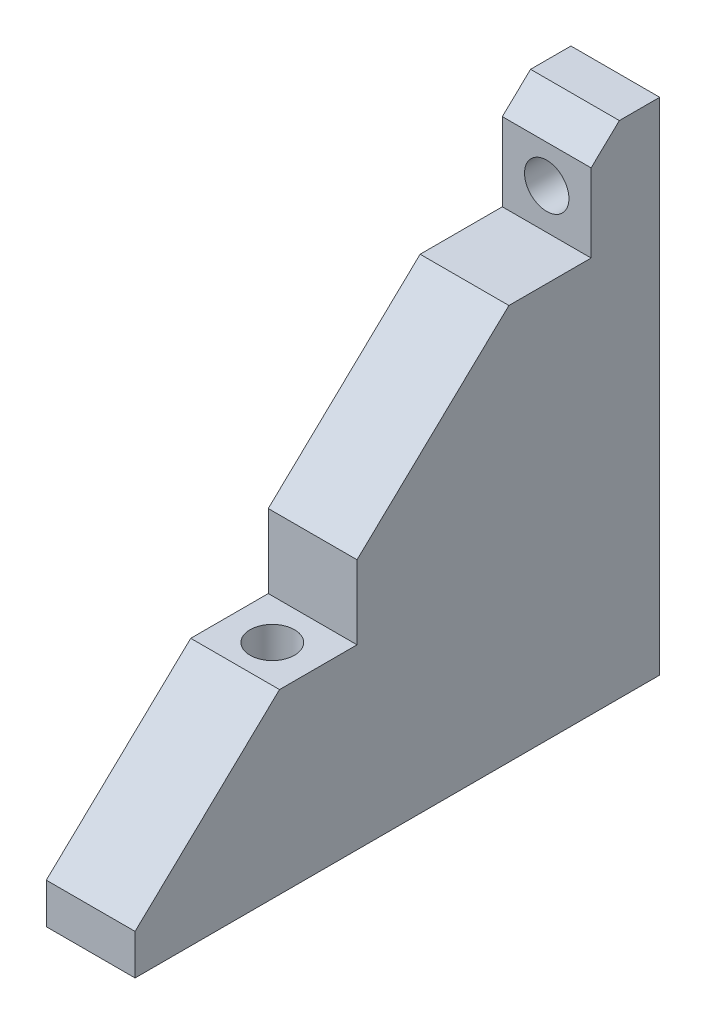
ISO-10303-21;
HEADER;
FILE_DESCRIPTION(('STEP AP214'),'2;1');
FILE_NAME('part.step','',(''),(''),'','','');
FILE_SCHEMA(('AUTOMOTIVE_DESIGN { 1 0 10303 214 1 1 1 1 }'));
ENDSEC;
DATA;
#1=APPLICATION_CONTEXT('core data for automotive mechanical design processes');
#2=APPLICATION_PROTOCOL_DEFINITION('international standard','automotive_design',2000,#1);
#3=PRODUCT_CONTEXT('',#1,'mechanical');
#4=PRODUCT('Part','Part','',(#3));
#5=PRODUCT_RELATED_PRODUCT_CATEGORY('part','',(#4));
#6=PRODUCT_DEFINITION_FORMATION('','',#4);
#7=PRODUCT_DEFINITION_CONTEXT('part definition',#1,'design');
#8=PRODUCT_DEFINITION('design','',#6,#7);
#9=PRODUCT_DEFINITION_SHAPE('','',#8);
#10=(LENGTH_UNIT() NAMED_UNIT(*) SI_UNIT(.MILLI.,.METRE.));
#11=(NAMED_UNIT(*) PLANE_ANGLE_UNIT() SI_UNIT($,.RADIAN.));
#12=(NAMED_UNIT(*) SI_UNIT($,.STERADIAN.) SOLID_ANGLE_UNIT());
#13=UNCERTAINTY_MEASURE_WITH_UNIT(LENGTH_MEASURE(1.E-05),#10,'distance_accuracy_value','');
#14=(GEOMETRIC_REPRESENTATION_CONTEXT(3) GLOBAL_UNCERTAINTY_ASSIGNED_CONTEXT((#13)) GLOBAL_UNIT_ASSIGNED_CONTEXT((#10,
#11,#12)) REPRESENTATION_CONTEXT('',''));
#15=CARTESIAN_POINT('',(0.,0.,0.));
#16=DIRECTION('',(0.,0.,1.));
#17=DIRECTION('',(1.,0.,0.));
#18=AXIS2_PLACEMENT_3D('',#15,#16,#17);
#19=CARTESIAN_POINT('',(-32.5,-80.,-5.));
#20=DIRECTION('',(0.,1.,0.));
#21=DIRECTION('',(0.,0.,1.));
#22=AXIS2_PLACEMENT_3D('',#19,#20,#21);
#23=PLANE('',#22);
#24=DIRECTION('',(0.,0.,1.));
#25=VECTOR('',#24,1.);
#26=CARTESIAN_POINT('',(-25.5,-80.,-5.));
#27=LINE('',#26,#25);
#28=CARTESIAN_POINT('',(-25.5,-80.,-5.));
#29=VERTEX_POINT('',#28);
#30=CARTESIAN_POINT('',(-25.5,-80.,0.));
#31=VERTEX_POINT('',#30);
#32=EDGE_CURVE('E80',#29,#31,#27,.T.);
#33=ORIENTED_EDGE('',*,*,#32,.T.);
#34=DIRECTION('',(1.,0.,0.));
#35=VECTOR('',#34,1.);
#36=CARTESIAN_POINT('',(-32.5,-80.,0.));
#37=LINE('',#36,#35);
#38=CARTESIAN_POINT('',(-14.5,-80.,0.));
#39=VERTEX_POINT('',#38);
#40=EDGE_CURVE('E87',#31,#39,#37,.T.);
#41=ORIENTED_EDGE('',*,*,#40,.T.);
#42=DIRECTION('',(0.,0.,1.));
#43=VECTOR('',#42,1.);
#44=CARTESIAN_POINT('',(-14.5,-80.,-5.));
#45=LINE('',#44,#43);
#46=CARTESIAN_POINT('',(-14.5,-80.,-5.));
#47=VERTEX_POINT('',#46);
#48=EDGE_CURVE('E131',#47,#39,#45,.T.);
#49=ORIENTED_EDGE('',*,*,#48,.F.);
#50=DIRECTION('',(-1.,0.,0.));
#51=VECTOR('',#50,1.);
#52=CARTESIAN_POINT('',(-32.5,-80.,-5.));
#53=LINE('',#52,#51);
#54=EDGE_CURVE('E89',#47,#29,#53,.T.);
#55=ORIENTED_EDGE('',*,*,#54,.T.);
#56=EDGE_LOOP('',(#33,#41,#49,#55));
#57=FACE_BOUND('',#56,.T.);
#58=ADVANCED_FACE('F39',(#57),#23,.T.);
#59=CARTESIAN_POINT('',(0.,0.,-5.));
#60=DIRECTION('',(0.,0.,-1.));
#61=DIRECTION('',(-1.,0.,0.));
#62=AXIS2_PLACEMENT_3D('',#59,#60,#61);
#63=PLANE('',#62);
#64=DIRECTION('',(0.,1.,0.));
#65=VECTOR('',#64,1.);
#66=CARTESIAN_POINT('',(-25.5,-80.,-5.));
#67=LINE('',#66,#65);
#68=CARTESIAN_POINT('',(-25.5,-142.,-5.));
#69=VERTEX_POINT('',#68);
#70=EDGE_CURVE('E113',#69,#29,#67,.T.);
#71=ORIENTED_EDGE('',*,*,#70,.T.);
#72=ORIENTED_EDGE('',*,*,#54,.F.);
#73=DIRECTION('',(0.,-1.,0.));
#74=VECTOR('',#73,1.);
#75=CARTESIAN_POINT('',(-14.5,-80.,-5.));
#76=LINE('',#75,#74);
#77=CARTESIAN_POINT('',(-14.5,-142.,-5.));
#78=VERTEX_POINT('',#77);
#79=EDGE_CURVE('E127',#47,#78,#76,.T.);
#80=ORIENTED_EDGE('',*,*,#79,.T.);
#81=DIRECTION('',(1.,0.,0.));
#82=VECTOR('',#81,1.);
#83=CARTESIAN_POINT('',(-32.5,-142.,-5.));
#84=LINE('',#83,#82);
#85=EDGE_CURVE('E116',#69,#78,#84,.T.);
#86=ORIENTED_EDGE('',*,*,#85,.F.);
#87=EDGE_LOOP('',(#71,#72,#80,#86));
#88=FACE_BOUND('',#87,.T.);
#89=CARTESIAN_POINT('',(-20.,-88.,-5.));
#90=DIRECTION('',(0.,0.,1.));
#91=DIRECTION('',(1.,0.,0.));
#92=AXIS2_PLACEMENT_3D('',#89,#90,#91);
#93=CIRCLE('',#92,2.75);
#94=CARTESIAN_POINT('',(-17.25,-88.,-5.));
#95=VERTEX_POINT('',#94);
#96=EDGE_CURVE('E124',#95,#95,#93,.T.);
#97=ORIENTED_EDGE('',*,*,#96,.T.);
#98=EDGE_LOOP('',(#97));
#99=FACE_BOUND('',#98,.T.);
#100=ADVANCED_FACE('F275',(#88,#99),#63,.T.);
#101=CARTESIAN_POINT('',(0.,-142.,0.));
#102=DIRECTION('',(0.,1.,0.));
#103=DIRECTION('',(0.,0.,1.));
#104=AXIS2_PLACEMENT_3D('',#101,#102,#103);
#105=PLANE('',#104);
#106=CARTESIAN_POINT('',(-20.,-142.,37.5));
#107=DIRECTION('',(0.,-1.,0.));
#108=DIRECTION('',(0.,0.,1.));
#109=AXIS2_PLACEMENT_3D('',#106,#107,#108);
#110=CIRCLE('',#109,2.75);
#111=CARTESIAN_POINT('',(-20.,-142.,40.25));
#112=VERTEX_POINT('',#111);
#113=EDGE_CURVE('E197',#112,#112,#110,.T.);
#114=ORIENTED_EDGE('',*,*,#113,.F.);
#115=EDGE_LOOP('',(#114));
#116=FACE_BOUND('',#115,.T.);
#117=CARTESIAN_POINT('',(-20.,-142.,7.50000000000001));
#118=DIRECTION('',(0.,-1.,0.));
#119=DIRECTION('',(0.,0.,1.));
#120=AXIS2_PLACEMENT_3D('',#117,#118,#119);
#121=CIRCLE('',#120,5.);
#122=CARTESIAN_POINT('',(-20.,-142.,12.5));
#123=VERTEX_POINT('',#122);
#124=EDGE_CURVE('E202',#123,#123,#121,.T.);
#125=ORIENTED_EDGE('',*,*,#124,.F.);
#126=EDGE_LOOP('',(#125));
#127=FACE_BOUND('',#126,.T.);
#128=CARTESIAN_POINT('',(-20.,-142.,47.5));
#129=DIRECTION('',(0.,-1.,0.));
#130=DIRECTION('',(0.,0.,-1.));
#131=AXIS2_PLACEMENT_3D('',#128,#129,#130);
#132=CIRCLE('',#131,5.);
#133=CARTESIAN_POINT('',(-20.,-142.,42.5));
#134=VERTEX_POINT('',#133);
#135=EDGE_CURVE('E206',#134,#134,#132,.T.);
#136=ORIENTED_EDGE('',*,*,#135,.F.);
#137=EDGE_LOOP('',(#136));
#138=FACE_BOUND('',#137,.T.);
#139=DIRECTION('',(-1.,0.,0.));
#140=VECTOR('',#139,1.);
#141=CARTESIAN_POINT('',(-32.5,-142.,60.));
#142=LINE('',#141,#140);
#143=CARTESIAN_POINT('',(-14.5,-142.,60.));
#144=VERTEX_POINT('',#143);
#145=CARTESIAN_POINT('',(-25.5,-142.,60.));
#146=VERTEX_POINT('',#145);
#147=EDGE_CURVE('E121',#144,#146,#142,.T.);
#148=ORIENTED_EDGE('',*,*,#147,.T.);
#149=DIRECTION('',(0.,0.,1.));
#150=VECTOR('',#149,1.);
#151=CARTESIAN_POINT('',(-25.5,-142.,-5.));
#152=LINE('',#151,#150);
#153=EDGE_CURVE('E49',#69,#146,#152,.T.);
#154=ORIENTED_EDGE('',*,*,#153,.F.);
#155=ORIENTED_EDGE('',*,*,#85,.T.);
#156=DIRECTION('',(0.,0.,1.));
#157=VECTOR('',#156,1.);
#158=CARTESIAN_POINT('',(-14.5,-142.,-5.));
#159=LINE('',#158,#157);
#160=EDGE_CURVE('E120',#78,#144,#159,.T.);
#161=ORIENTED_EDGE('',*,*,#160,.T.);
#162=EDGE_LOOP('',(#148,#154,#155,#161));
#163=FACE_BOUND('',#162,.T.);
#164=ADVANCED_FACE('F272',(#116,#127,#138,#163),#105,.F.);
#165=CARTESIAN_POINT('',(-32.5,-142.,60.));
#166=DIRECTION('',(0.,0.,-1.));
#167=DIRECTION('',(-1.,0.,0.));
#168=AXIS2_PLACEMENT_3D('',#165,#166,#167);
#169=PLANE('',#168);
#170=DIRECTION('',(1.,0.,0.));
#171=VECTOR('',#170,1.);
#172=CARTESIAN_POINT('',(-32.5,-137.,60.));
#173=LINE('',#172,#171);
#174=CARTESIAN_POINT('',(-25.5,-137.,60.));
#175=VERTEX_POINT('',#174);
#176=CARTESIAN_POINT('',(-14.5,-137.,60.));
#177=VERTEX_POINT('',#176);
#178=EDGE_CURVE('E42',#175,#177,#173,.T.);
#179=ORIENTED_EDGE('',*,*,#178,.F.);
#180=DIRECTION('',(0.,1.,0.));
#181=VECTOR('',#180,1.);
#182=CARTESIAN_POINT('',(-25.5,-80.,60.));
#183=LINE('',#182,#181);
#184=EDGE_CURVE('E11',#146,#175,#183,.T.);
#185=ORIENTED_EDGE('',*,*,#184,.F.);
#186=ORIENTED_EDGE('',*,*,#147,.F.);
#187=DIRECTION('',(0.,-1.,0.));
#188=VECTOR('',#187,1.);
#189=CARTESIAN_POINT('',(-14.5,-80.,60.));
#190=LINE('',#189,#188);
#191=EDGE_CURVE('E135',#177,#144,#190,.T.);
#192=ORIENTED_EDGE('',*,*,#191,.F.);
#193=EDGE_LOOP('',(#179,#185,#186,#192));
#194=FACE_BOUND('',#193,.T.);
#195=ADVANCED_FACE('F268',(#194),#169,.F.);
#196=CARTESIAN_POINT('',(-32.5,-137.,60.));
#197=DIRECTION('',(0.,-0.724999433594413,-0.688749461914693));
#198=DIRECTION('',(0.,0.688749461914694,-0.724999433594413));
#199=AXIS2_PLACEMENT_3D('',#196,#197,#198);
#200=PLANE('',#199);
#201=DIRECTION('',(-1.,0.,0.));
#202=VECTOR('',#201,1.);
#203=CARTESIAN_POINT('',(-32.5,-83.325,3.5));
#204=LINE('',#203,#202);
#205=CARTESIAN_POINT('',(-14.5,-83.325,3.5));
#206=VERTEX_POINT('',#205);
#207=CARTESIAN_POINT('',(-25.5,-83.325,3.5));
#208=VERTEX_POINT('',#207);
#209=EDGE_CURVE('E153',#206,#208,#204,.T.);
#210=ORIENTED_EDGE('',*,*,#209,.F.);
#211=DIRECTION('',(0.,-0.688749461914694,0.724999433594413));
#212=VECTOR('',#211,1.);
#213=CARTESIAN_POINT('',(-14.5,-51.0630749014454,-30.4599211563732));
#214=LINE('',#213,#212);
#215=EDGE_CURVE('E110',#39,#206,#214,.T.);
#216=ORIENTED_EDGE('',*,*,#215,.F.);
#217=ORIENTED_EDGE('',*,*,#40,.F.);
#218=DIRECTION('',(0.,0.688749461914694,-0.724999433594413));
#219=VECTOR('',#218,1.);
#220=CARTESIAN_POINT('',(-25.5,-51.0630749014454,-30.4599211563732));
#221=LINE('',#220,#219);
#222=EDGE_CURVE('E94',#208,#31,#221,.T.);
#223=ORIENTED_EDGE('',*,*,#222,.F.);
#224=EDGE_LOOP('',(#210,#216,#217,#223));
#225=FACE_BOUND('',#224,.T.);
#226=ADVANCED_FACE('F108',(#225),#200,.F.);
#227=CARTESIAN_POINT('',(-20.,-88.,-5.));
#228=DIRECTION('',(0.,0.,1.));
#229=DIRECTION('',(1.,0.,0.));
#230=AXIS2_PLACEMENT_3D('',#227,#228,#229);
#231=CYLINDRICAL_SURFACE('',#230,2.75);
#232=ORIENTED_EDGE('',*,*,#96,.F.);
#233=EDGE_LOOP('',(#232));
#234=FACE_BOUND('',#233,.T.);
#235=CARTESIAN_POINT('',(-20.,-88.,3.5));
#236=DIRECTION('',(0.,0.,1.));
#237=DIRECTION('',(1.,0.,0.));
#238=AXIS2_PLACEMENT_3D('',#235,#236,#237);
#239=CIRCLE('',#238,2.75);
#240=CARTESIAN_POINT('',(-17.25,-88.,3.5));
#241=VERTEX_POINT('',#240);
#242=EDGE_CURVE('E158',#241,#241,#239,.F.);
#243=ORIENTED_EDGE('',*,*,#242,.F.);
#244=EDGE_LOOP('',(#243));
#245=FACE_BOUND('',#244,.T.);
#246=ADVANCED_FACE('F280',(#234,#245),#231,.F.);
#247=CARTESIAN_POINT('',(-25.5,-19.,0.));
#248=DIRECTION('',(1.,0.,0.));
#249=DIRECTION('',(0.,0.,-1.));
#250=AXIS2_PLACEMENT_3D('',#247,#248,#249);
#251=PLANE('',#250);
#252=CARTESIAN_POINT('',(-25.5,-110.875,32.5));
#253=VERTEX_POINT('',#252);
#254=CARTESIAN_POINT('',(-25.5,-93.,13.6842105263158));
#255=VERTEX_POINT('',#254);
#256=EDGE_CURVE('E105',#253,#255,#221,.T.);
#257=ORIENTED_EDGE('',*,*,#256,.T.);
#258=DIRECTION('',(0.,0.,1.));
#259=VECTOR('',#258,1.);
#260=CARTESIAN_POINT('',(-25.5,-93.,3.5));
#261=LINE('',#260,#259);
#262=CARTESIAN_POINT('',(-25.5,-93.,3.5));
#263=VERTEX_POINT('',#262);
#264=EDGE_CURVE('E154',#263,#255,#261,.T.);
#265=ORIENTED_EDGE('',*,*,#264,.F.);
#266=DIRECTION('',(0.,-1.,0.));
#267=VECTOR('',#266,1.);
#268=CARTESIAN_POINT('',(-25.5,-142.,3.5));
#269=LINE('',#268,#267);
#270=EDGE_CURVE('E100',#208,#263,#269,.T.);
#271=ORIENTED_EDGE('',*,*,#270,.F.);
#272=ORIENTED_EDGE('',*,*,#222,.T.);
#273=ORIENTED_EDGE('',*,*,#32,.F.);
#274=ORIENTED_EDGE('',*,*,#70,.F.);
#275=ORIENTED_EDGE('',*,*,#153,.T.);
#276=ORIENTED_EDGE('',*,*,#184,.T.);
#277=CARTESIAN_POINT('',(-25.5,-120.,42.1052631578947));
#278=VERTEX_POINT('',#277);
#279=EDGE_CURVE('E104',#175,#278,#221,.T.);
#280=ORIENTED_EDGE('',*,*,#279,.T.);
#281=DIRECTION('',(0.,0.,-1.));
#282=VECTOR('',#281,1.);
#283=CARTESIAN_POINT('',(-25.5,-120.,-5.));
#284=LINE('',#283,#282);
#285=CARTESIAN_POINT('',(-25.5,-120.,32.5));
#286=VERTEX_POINT('',#285);
#287=EDGE_CURVE('E180',#278,#286,#284,.T.);
#288=ORIENTED_EDGE('',*,*,#287,.T.);
#289=DIRECTION('',(0.,1.,0.));
#290=VECTOR('',#289,1.);
#291=CARTESIAN_POINT('',(-25.5,-120.,32.5));
#292=LINE('',#291,#290);
#293=EDGE_CURVE('E165',#286,#253,#292,.T.);
#294=ORIENTED_EDGE('',*,*,#293,.T.);
#295=EDGE_LOOP('',(#257,#265,#271,#272,#273,#274,#275,#276,#280,#288,#294));
#296=FACE_BOUND('',#295,.T.);
#297=ADVANCED_FACE('F96',(#296),#251,.F.);
#298=CARTESIAN_POINT('',(-14.5,-19.,0.));
#299=DIRECTION('',(-1.,0.,0.));
#300=DIRECTION('',(0.,0.,1.));
#301=AXIS2_PLACEMENT_3D('',#298,#299,#300);
#302=PLANE('',#301);
#303=DIRECTION('',(0.,1.,0.));
#304=VECTOR('',#303,1.);
#305=CARTESIAN_POINT('',(-14.5000000000002,-142.,3.5));
#306=LINE('',#305,#304);
#307=CARTESIAN_POINT('',(-14.5,-93.,3.5));
#308=VERTEX_POINT('',#307);
#309=EDGE_CURVE('E138',#308,#206,#306,.T.);
#310=ORIENTED_EDGE('',*,*,#309,.F.);
#311=DIRECTION('',(0.,0.,1.));
#312=VECTOR('',#311,1.);
#313=CARTESIAN_POINT('',(-14.5,-93.,3.5));
#314=LINE('',#313,#312);
#315=CARTESIAN_POINT('',(-14.5,-93.,13.6842105263157));
#316=VERTEX_POINT('',#315);
#317=EDGE_CURVE('E160',#308,#316,#314,.T.);
#318=ORIENTED_EDGE('',*,*,#317,.T.);
#319=CARTESIAN_POINT('',(-14.5,-110.875,32.5));
#320=VERTEX_POINT('',#319);
#321=EDGE_CURVE('E164',#316,#320,#214,.T.);
#322=ORIENTED_EDGE('',*,*,#321,.T.);
#323=DIRECTION('',(0.,1.,0.));
#324=VECTOR('',#323,1.);
#325=CARTESIAN_POINT('',(-14.5,-120.,32.5));
#326=LINE('',#325,#324);
#327=CARTESIAN_POINT('',(-14.5,-120.,32.5));
#328=VERTEX_POINT('',#327);
#329=EDGE_CURVE('E173',#328,#320,#326,.T.);
#330=ORIENTED_EDGE('',*,*,#329,.F.);
#331=DIRECTION('',(0.,0.,1.));
#332=VECTOR('',#331,1.);
#333=CARTESIAN_POINT('',(-14.5,-120.,-5.));
#334=LINE('',#333,#332);
#335=CARTESIAN_POINT('',(-14.5,-120.,42.1052631578947));
#336=VERTEX_POINT('',#335);
#337=EDGE_CURVE('E175',#328,#336,#334,.T.);
#338=ORIENTED_EDGE('',*,*,#337,.T.);
#339=EDGE_CURVE('E179',#336,#177,#214,.T.);
#340=ORIENTED_EDGE('',*,*,#339,.T.);
#341=ORIENTED_EDGE('',*,*,#191,.T.);
#342=ORIENTED_EDGE('',*,*,#160,.F.);
#343=ORIENTED_EDGE('',*,*,#79,.F.);
#344=ORIENTED_EDGE('',*,*,#48,.T.);
#345=ORIENTED_EDGE('',*,*,#215,.T.);
#346=EDGE_LOOP('',(#310,#318,#322,#330,#338,#340,#341,#342,#343,#344,#345));
#347=FACE_BOUND('',#346,.T.);
#348=ADVANCED_FACE('F256',(#347),#302,.F.);
#349=ORIENTED_EDGE('',*,*,#321,.F.);
#350=DIRECTION('',(-1.,0.,0.));
#351=VECTOR('',#350,1.);
#352=CARTESIAN_POINT('',(-32.5,-93.,13.6842105263158));
#353=LINE('',#352,#351);
#354=EDGE_CURVE('E214',#316,#255,#353,.T.);
#355=ORIENTED_EDGE('',*,*,#354,.T.);
#356=ORIENTED_EDGE('',*,*,#256,.F.);
#357=DIRECTION('',(-1.,0.,0.));
#358=VECTOR('',#357,1.);
#359=CARTESIAN_POINT('',(-32.5,-110.875,32.5));
#360=LINE('',#359,#358);
#361=EDGE_CURVE('E174',#320,#253,#360,.T.);
#362=ORIENTED_EDGE('',*,*,#361,.F.);
#363=EDGE_LOOP('',(#349,#355,#356,#362));
#364=FACE_BOUND('',#363,.T.);
#365=ADVANCED_FACE('F237',(#364),#200,.F.);
#366=CARTESIAN_POINT('',(-20.,-142.,47.5));
#367=DIRECTION('',(0.,1.,0.));
#368=DIRECTION('',(0.,0.,1.));
#369=AXIS2_PLACEMENT_3D('',#366,#367,#368);
#370=CYLINDRICAL_SURFACE('',#369,5.);
#371=ORIENTED_EDGE('',*,*,#135,.T.);
#372=EDGE_LOOP('',(#371));
#373=FACE_BOUND('',#372,.T.);
#374=CARTESIAN_POINT('',(-20.,-137.,47.5));
#375=DIRECTION('',(0.,-1.,0.));
#376=DIRECTION('',(0.,0.,-1.));
#377=AXIS2_PLACEMENT_3D('',#374,#375,#376);
#378=CIRCLE('',#377,5.);
#379=CARTESIAN_POINT('',(-20.,-137.,42.5));
#380=VERTEX_POINT('',#379);
#381=EDGE_CURVE('E210',#380,#380,#378,.T.);
#382=ORIENTED_EDGE('',*,*,#381,.F.);
#383=EDGE_LOOP('',(#382));
#384=FACE_BOUND('',#383,.T.);
#385=ADVANCED_FACE('F384',(#373,#384),#370,.F.);
#386=CARTESIAN_POINT('',(-20.,-142.,7.50000000000001));
#387=DIRECTION('',(0.,1.,0.));
#388=DIRECTION('',(0.,0.,1.));
#389=AXIS2_PLACEMENT_3D('',#386,#387,#388);
#390=CYLINDRICAL_SURFACE('',#389,5.);
#391=ORIENTED_EDGE('',*,*,#124,.T.);
#392=EDGE_LOOP('',(#391));
#393=FACE_BOUND('',#392,.T.);
#394=CARTESIAN_POINT('',(-20.,-137.,7.50000000000001));
#395=DIRECTION('',(0.,-1.,0.));
#396=DIRECTION('',(0.,0.,1.));
#397=AXIS2_PLACEMENT_3D('',#394,#395,#396);
#398=CIRCLE('',#397,5.);
#399=CARTESIAN_POINT('',(-20.,-137.,12.5));
#400=VERTEX_POINT('',#399);
#401=EDGE_CURVE('E201',#400,#400,#398,.T.);
#402=ORIENTED_EDGE('',*,*,#401,.F.);
#403=EDGE_LOOP('',(#402));
#404=FACE_BOUND('',#403,.T.);
#405=ADVANCED_FACE('F390',(#393,#404),#390,.F.);
#406=CARTESIAN_POINT('',(-20.,-142.,37.5));
#407=DIRECTION('',(0.,1.,0.));
#408=DIRECTION('',(0.,0.,1.));
#409=AXIS2_PLACEMENT_3D('',#406,#407,#408);
#410=CYLINDRICAL_SURFACE('',#409,2.75);
#411=CARTESIAN_POINT('',(-20.,-120.,37.5));
#412=DIRECTION('',(0.,-1.,0.));
#413=DIRECTION('',(0.,0.,-1.));
#414=AXIS2_PLACEMENT_3D('',#411,#412,#413);
#415=CIRCLE('',#414,2.75);
#416=CARTESIAN_POINT('',(-20.,-120.,34.75));
#417=VERTEX_POINT('',#416);
#418=EDGE_CURVE('E159',#417,#417,#415,.T.);
#419=ORIENTED_EDGE('',*,*,#418,.F.);
#420=EDGE_LOOP('',(#419));
#421=FACE_BOUND('',#420,.T.);
#422=ORIENTED_EDGE('',*,*,#113,.T.);
#423=EDGE_LOOP('',(#422));
#424=FACE_BOUND('',#423,.T.);
#425=ADVANCED_FACE('F398',(#421,#424),#410,.F.);
#426=CARTESIAN_POINT('',(0.,-137.,0.));
#427=DIRECTION('',(0.,1.,0.));
#428=DIRECTION('',(0.,0.,1.));
#429=AXIS2_PLACEMENT_3D('',#426,#427,#428);
#430=PLANE('',#429);
#431=ORIENTED_EDGE('',*,*,#401,.T.);
#432=EDGE_LOOP('',(#431));
#433=FACE_BOUND('',#432,.T.);
#434=ADVANCED_FACE('F406',(#433),#430,.F.);
#435=ORIENTED_EDGE('',*,*,#381,.T.);
#436=EDGE_LOOP('',(#435));
#437=FACE_BOUND('',#436,.T.);
#438=ADVANCED_FACE('F321',(#437),#430,.F.);
#439=ORIENTED_EDGE('',*,*,#339,.F.);
#440=DIRECTION('',(-1.,0.,0.));
#441=VECTOR('',#440,1.);
#442=CARTESIAN_POINT('',(-32.5,-120.,42.1052631578947));
#443=LINE('',#442,#441);
#444=EDGE_CURVE('E218',#336,#278,#443,.T.);
#445=ORIENTED_EDGE('',*,*,#444,.T.);
#446=ORIENTED_EDGE('',*,*,#279,.F.);
#447=ORIENTED_EDGE('',*,*,#178,.T.);
#448=EDGE_LOOP('',(#439,#445,#446,#447));
#449=FACE_BOUND('',#448,.T.);
#450=ADVANCED_FACE('F265',(#449),#200,.F.);
#451=CARTESIAN_POINT('',(-32.5,-120.,32.5));
#452=DIRECTION('',(0.,0.,1.));
#453=DIRECTION('',(1.,0.,0.));
#454=AXIS2_PLACEMENT_3D('',#451,#452,#453);
#455=PLANE('',#454);
#456=ORIENTED_EDGE('',*,*,#361,.T.);
#457=ORIENTED_EDGE('',*,*,#293,.F.);
#458=DIRECTION('',(1.,0.,0.));
#459=VECTOR('',#458,1.);
#460=CARTESIAN_POINT('',(-32.5,-120.,32.5));
#461=LINE('',#460,#459);
#462=EDGE_CURVE('E169',#286,#328,#461,.T.);
#463=ORIENTED_EDGE('',*,*,#462,.T.);
#464=ORIENTED_EDGE('',*,*,#329,.T.);
#465=EDGE_LOOP('',(#456,#457,#463,#464));
#466=FACE_BOUND('',#465,.T.);
#467=ADVANCED_FACE('F312',(#466),#455,.T.);
#468=CARTESIAN_POINT('',(0.,-120.,0.));
#469=DIRECTION('',(0.,-1.,0.));
#470=DIRECTION('',(0.,0.,-1.));
#471=AXIS2_PLACEMENT_3D('',#468,#469,#470);
#472=PLANE('',#471);
#473=ORIENTED_EDGE('',*,*,#418,.T.);
#474=EDGE_LOOP('',(#473));
#475=FACE_BOUND('',#474,.T.);
#476=ORIENTED_EDGE('',*,*,#337,.F.);
#477=ORIENTED_EDGE('',*,*,#462,.F.);
#478=ORIENTED_EDGE('',*,*,#287,.F.);
#479=ORIENTED_EDGE('',*,*,#444,.F.);
#480=EDGE_LOOP('',(#476,#477,#478,#479));
#481=FACE_BOUND('',#480,.T.);
#482=ADVANCED_FACE('F310',(#475,#481),#472,.F.);
#483=CARTESIAN_POINT('',(-32.5,-93.,3.5));
#484=DIRECTION('',(0.,-1.,0.));
#485=DIRECTION('',(0.,0.,-1.));
#486=AXIS2_PLACEMENT_3D('',#483,#484,#485);
#487=PLANE('',#486);
#488=ORIENTED_EDGE('',*,*,#317,.F.);
#489=DIRECTION('',(1.,0.,0.));
#490=VECTOR('',#489,1.);
#491=CARTESIAN_POINT('',(-32.5,-93.,3.5));
#492=LINE('',#491,#490);
#493=EDGE_CURVE('E144',#263,#308,#492,.T.);
#494=ORIENTED_EDGE('',*,*,#493,.F.);
#495=ORIENTED_EDGE('',*,*,#264,.T.);
#496=ORIENTED_EDGE('',*,*,#354,.F.);
#497=EDGE_LOOP('',(#488,#494,#495,#496));
#498=FACE_BOUND('',#497,.T.);
#499=ADVANCED_FACE('F289',(#498),#487,.F.);
#500=CARTESIAN_POINT('',(0.,0.,3.5));
#501=DIRECTION('',(0.,0.,1.));
#502=DIRECTION('',(1.,0.,0.));
#503=AXIS2_PLACEMENT_3D('',#500,#501,#502);
#504=PLANE('',#503);
#505=ORIENTED_EDGE('',*,*,#242,.T.);
#506=EDGE_LOOP('',(#505));
#507=FACE_BOUND('',#506,.T.);
#508=ORIENTED_EDGE('',*,*,#209,.T.);
#509=ORIENTED_EDGE('',*,*,#270,.T.);
#510=ORIENTED_EDGE('',*,*,#493,.T.);
#511=ORIENTED_EDGE('',*,*,#309,.T.);
#512=EDGE_LOOP('',(#508,#509,#510,#511));
#513=FACE_BOUND('',#512,.T.);
#514=ADVANCED_FACE('F286',(#507,#513),#504,.T.);
#515=CLOSED_SHELL('',(#58,#100,#164,#195,#226,#246,#297,#348,#365,#385,#405,#425,#434,#438,#450,
#467,#482,#499,#514));
#516=MANIFOLD_SOLID_BREP('B2',#515);
#517=ADVANCED_BREP_SHAPE_REPRESENTATION('',(#18,#516),#14);
#518=SHAPE_DEFINITION_REPRESENTATION(#9,#517);
ENDSEC;
END-ISO-10303-21;
